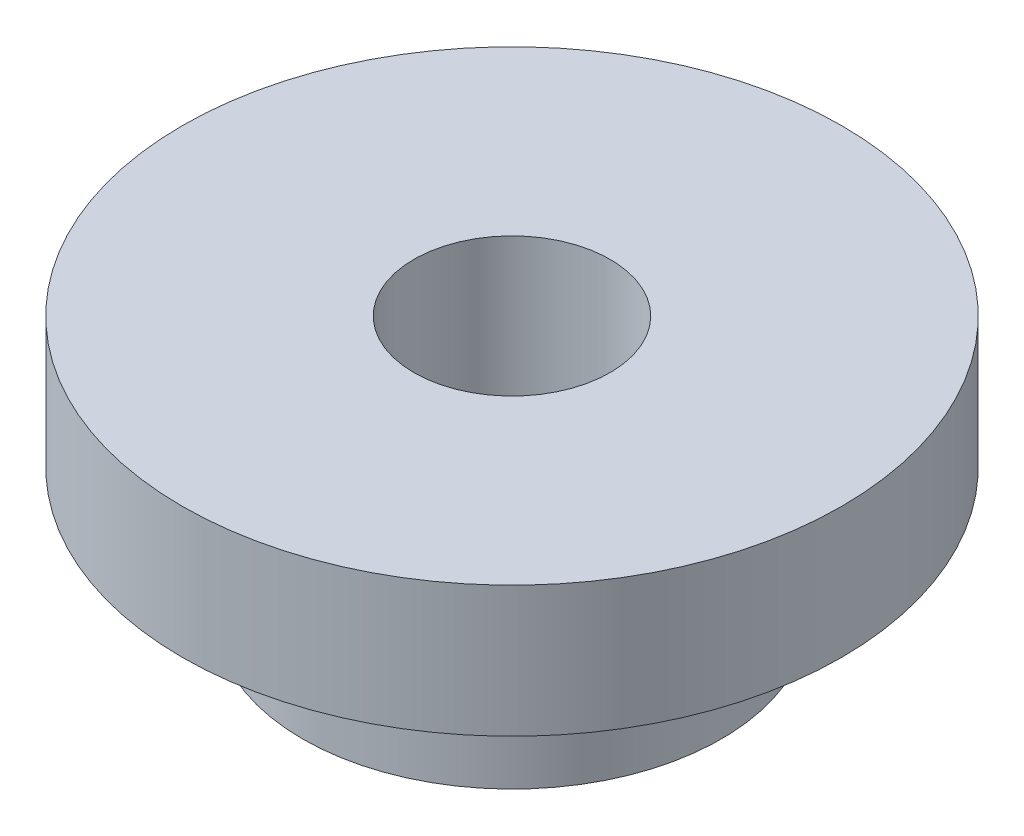
ISO-10303-21;
HEADER;
FILE_DESCRIPTION(('STEP AP214'),'2;1');
FILE_NAME('part.step','',(''),(''),'','','');
FILE_SCHEMA(('AUTOMOTIVE_DESIGN { 1 0 10303 214 1 1 1 1 }'));
ENDSEC;
DATA;
#1=APPLICATION_CONTEXT('core data for automotive mechanical design processes');
#2=APPLICATION_PROTOCOL_DEFINITION('international standard','automotive_design',2000,#1);
#3=PRODUCT_CONTEXT('',#1,'mechanical');
#4=PRODUCT('Part','Part','',(#3));
#5=PRODUCT_RELATED_PRODUCT_CATEGORY('part','',(#4));
#6=PRODUCT_DEFINITION_FORMATION('','',#4);
#7=PRODUCT_DEFINITION_CONTEXT('part definition',#1,'design');
#8=PRODUCT_DEFINITION('design','',#6,#7);
#9=PRODUCT_DEFINITION_SHAPE('','',#8);
#10=(LENGTH_UNIT() NAMED_UNIT(*) SI_UNIT(.MILLI.,.METRE.));
#11=(NAMED_UNIT(*) PLANE_ANGLE_UNIT() SI_UNIT($,.RADIAN.));
#12=(NAMED_UNIT(*) SI_UNIT($,.STERADIAN.) SOLID_ANGLE_UNIT());
#13=UNCERTAINTY_MEASURE_WITH_UNIT(LENGTH_MEASURE(1.E-05),#10,'distance_accuracy_value','');
#14=(GEOMETRIC_REPRESENTATION_CONTEXT(3) GLOBAL_UNCERTAINTY_ASSIGNED_CONTEXT((#13)) GLOBAL_UNIT_ASSIGNED_CONTEXT((#10,
#11,#12)) REPRESENTATION_CONTEXT('',''));
#15=CARTESIAN_POINT('',(0.,0.,0.));
#16=DIRECTION('',(0.,0.,1.));
#17=DIRECTION('',(1.,0.,0.));
#18=AXIS2_PLACEMENT_3D('',#15,#16,#17);
#19=CARTESIAN_POINT('',(0.,148.74875,0.));
#20=DIRECTION('',(0.,1.,0.));
#21=DIRECTION('',(0.,0.,1.));
#22=AXIS2_PLACEMENT_3D('',#19,#20,#21);
#23=PLANE('',#22);
#24=CARTESIAN_POINT('',(0.,148.74875,0.));
#25=DIRECTION('',(0.,1.,0.));
#26=DIRECTION('',(0.,0.,1.));
#27=AXIS2_PLACEMENT_3D('',#24,#25,#26);
#28=CIRCLE('',#27,5.08);
#29=CARTESIAN_POINT('',(0.,148.74875,5.08));
#30=VERTEX_POINT('',#29);
#31=EDGE_CURVE('E34',#30,#30,#28,.T.);
#32=ORIENTED_EDGE('',*,*,#31,.F.);
#33=EDGE_LOOP('',(#32));
#34=FACE_BOUND('',#33,.T.);
#35=CARTESIAN_POINT('',(0.,148.74875,0.));
#36=DIRECTION('',(0.,1.,0.));
#37=DIRECTION('',(0.,0.,1.));
#38=AXIS2_PLACEMENT_3D('',#35,#36,#37);
#39=CIRCLE('',#38,2.38125);
#40=CARTESIAN_POINT('',(0.,148.74875,2.38125));
#41=VERTEX_POINT('',#40);
#42=EDGE_CURVE('E41',#41,#41,#39,.T.);
#43=ORIENTED_EDGE('',*,*,#42,.T.);
#44=EDGE_LOOP('',(#43));
#45=FACE_BOUND('',#44,.T.);
#46=ADVANCED_FACE('F30',(#34,#45),#23,.F.);
#47=CARTESIAN_POINT('',(0.,151.92375,0.));
#48=DIRECTION('',(0.,-1.,0.));
#49=DIRECTION('',(0.,0.,-1.));
#50=AXIS2_PLACEMENT_3D('',#47,#48,#49);
#51=CYLINDRICAL_SURFACE('',#50,5.08);
#52=CARTESIAN_POINT('',(0.,151.92375,0.));
#53=DIRECTION('',(0.,1.,0.));
#54=DIRECTION('',(0.,0.,1.));
#55=AXIS2_PLACEMENT_3D('',#52,#53,#54);
#56=CIRCLE('',#55,5.08);
#57=CARTESIAN_POINT('',(0.,151.92375,5.08));
#58=VERTEX_POINT('',#57);
#59=EDGE_CURVE('E10',#58,#58,#56,.T.);
#60=ORIENTED_EDGE('',*,*,#59,.F.);
#61=EDGE_LOOP('',(#60));
#62=FACE_BOUND('',#61,.T.);
#63=ORIENTED_EDGE('',*,*,#31,.T.);
#64=EDGE_LOOP('',(#63));
#65=FACE_BOUND('',#64,.T.);
#66=ADVANCED_FACE('F32',(#62,#65),#51,.T.);
#67=CARTESIAN_POINT('',(0.,151.92375,0.));
#68=DIRECTION('',(0.,-1.,0.));
#69=DIRECTION('',(0.,0.,-1.));
#70=AXIS2_PLACEMENT_3D('',#67,#68,#69);
#71=CYLINDRICAL_SURFACE('',#70,2.38125);
#72=ORIENTED_EDGE('',*,*,#42,.F.);
#73=EDGE_LOOP('',(#72));
#74=FACE_BOUND('',#73,.T.);
#75=CARTESIAN_POINT('',(0.,155.09875,0.));
#76=DIRECTION('',(0.,1.,0.));
#77=DIRECTION('',(0.,0.,1.));
#78=AXIS2_PLACEMENT_3D('',#75,#76,#77);
#79=CIRCLE('',#78,2.38125);
#80=CARTESIAN_POINT('',(0.,155.09875,2.38125));
#81=VERTEX_POINT('',#80);
#82=EDGE_CURVE('E49',#81,#81,#79,.T.);
#83=ORIENTED_EDGE('',*,*,#82,.T.);
#84=EDGE_LOOP('',(#83));
#85=FACE_BOUND('',#84,.T.);
#86=ADVANCED_FACE('F55',(#74,#85),#71,.F.);
#87=CARTESIAN_POINT('',(0.,151.92375,0.));
#88=DIRECTION('',(0.,1.,0.));
#89=DIRECTION('',(0.,0.,1.));
#90=AXIS2_PLACEMENT_3D('',#87,#88,#89);
#91=PLANE('',#90);
#92=CARTESIAN_POINT('',(0.,151.92375,0.));
#93=DIRECTION('',(0.,1.,0.));
#94=DIRECTION('',(0.,0.,1.));
#95=AXIS2_PLACEMENT_3D('',#92,#93,#94);
#96=CIRCLE('',#95,8.);
#97=CARTESIAN_POINT('',(0.,151.92375,8.));
#98=VERTEX_POINT('',#97);
#99=EDGE_CURVE('E46',#98,#98,#96,.T.);
#100=ORIENTED_EDGE('',*,*,#99,.F.);
#101=EDGE_LOOP('',(#100));
#102=FACE_BOUND('',#101,.T.);
#103=ORIENTED_EDGE('',*,*,#59,.T.);
#104=EDGE_LOOP('',(#103));
#105=FACE_BOUND('',#104,.T.);
#106=ADVANCED_FACE('F60',(#102,#105),#91,.F.);
#107=CARTESIAN_POINT('',(0.,155.09875,0.));
#108=DIRECTION('',(0.,1.,0.));
#109=DIRECTION('',(0.,0.,1.));
#110=AXIS2_PLACEMENT_3D('',#107,#108,#109);
#111=PLANE('',#110);
#112=CARTESIAN_POINT('',(0.,155.09875,0.));
#113=DIRECTION('',(0.,1.,0.));
#114=DIRECTION('',(0.,0.,1.));
#115=AXIS2_PLACEMENT_3D('',#112,#113,#114);
#116=CIRCLE('',#115,8.);
#117=CARTESIAN_POINT('',(0.,155.09875,8.));
#118=VERTEX_POINT('',#117);
#119=EDGE_CURVE('E45',#118,#118,#116,.T.);
#120=ORIENTED_EDGE('',*,*,#119,.T.);
#121=EDGE_LOOP('',(#120));
#122=FACE_BOUND('',#121,.T.);
#123=ORIENTED_EDGE('',*,*,#82,.F.);
#124=EDGE_LOOP('',(#123));
#125=FACE_BOUND('',#124,.T.);
#126=ADVANCED_FACE('F57',(#122,#125),#111,.T.);
#127=CARTESIAN_POINT('',(0.,155.09875,0.));
#128=DIRECTION('',(0.,-1.,0.));
#129=DIRECTION('',(0.,0.,-1.));
#130=AXIS2_PLACEMENT_3D('',#127,#128,#129);
#131=CYLINDRICAL_SURFACE('',#130,8.);
#132=ORIENTED_EDGE('',*,*,#119,.F.);
#133=EDGE_LOOP('',(#132));
#134=FACE_BOUND('',#133,.T.);
#135=ORIENTED_EDGE('',*,*,#99,.T.);
#136=EDGE_LOOP('',(#135));
#137=FACE_BOUND('',#136,.T.);
#138=ADVANCED_FACE('F59',(#134,#137),#131,.T.);
#139=CLOSED_SHELL('',(#46,#66,#86,#106,#126,#138));
#140=MANIFOLD_SOLID_BREP('B2',#139);
#141=ADVANCED_BREP_SHAPE_REPRESENTATION('',(#18,#140),#14);
#142=SHAPE_DEFINITION_REPRESENTATION(#9,#141);
ENDSEC;
END-ISO-10303-21;
